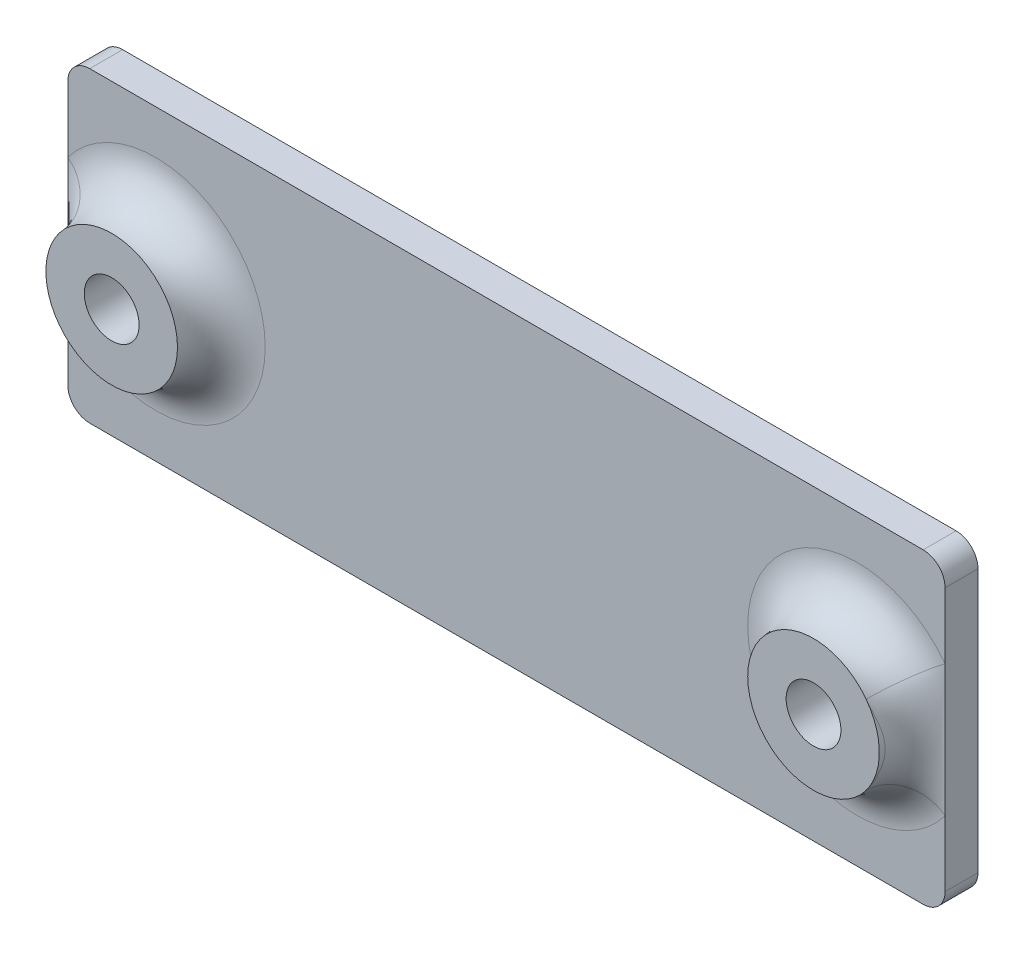
ISO-10303-21;
HEADER;
FILE_DESCRIPTION(('STEP AP214'),'2;1');
FILE_NAME('part.step','',(''),(''),'','','');
FILE_SCHEMA(('AUTOMOTIVE_DESIGN { 1 0 10303 214 1 1 1 1 }'));
ENDSEC;
DATA;
#1=APPLICATION_CONTEXT('core data for automotive mechanical design processes');
#2=APPLICATION_PROTOCOL_DEFINITION('international standard','automotive_design',2000,#1);
#3=PRODUCT_CONTEXT('',#1,'mechanical');
#4=PRODUCT('Part','Part','',(#3));
#5=PRODUCT_RELATED_PRODUCT_CATEGORY('part','',(#4));
#6=PRODUCT_DEFINITION_FORMATION('','',#4);
#7=PRODUCT_DEFINITION_CONTEXT('part definition',#1,'design');
#8=PRODUCT_DEFINITION('design','',#6,#7);
#9=PRODUCT_DEFINITION_SHAPE('','',#8);
#10=(LENGTH_UNIT() NAMED_UNIT(*) SI_UNIT(.MILLI.,.METRE.));
#11=(NAMED_UNIT(*) PLANE_ANGLE_UNIT() SI_UNIT($,.RADIAN.));
#12=(NAMED_UNIT(*) SI_UNIT($,.STERADIAN.) SOLID_ANGLE_UNIT());
#13=UNCERTAINTY_MEASURE_WITH_UNIT(LENGTH_MEASURE(1.E-05),#10,'distance_accuracy_value','');
#14=(GEOMETRIC_REPRESENTATION_CONTEXT(3) GLOBAL_UNCERTAINTY_ASSIGNED_CONTEXT((#13)) GLOBAL_UNIT_ASSIGNED_CONTEXT((#10,
#11,#12)) REPRESENTATION_CONTEXT('',''));
#15=CARTESIAN_POINT('',(0.,0.,0.));
#16=DIRECTION('',(0.,0.,1.));
#17=DIRECTION('',(1.,0.,0.));
#18=AXIS2_PLACEMENT_3D('',#15,#16,#17);
#19=CARTESIAN_POINT('',(-21.6888483995196,7.,1.5));
#20=DIRECTION('',(1.,0.,0.));
#21=DIRECTION('',(0.,1.,0.));
#22=AXIS2_PLACEMENT_3D('',#19,#20,#21);
#23=PLANE('',#22);
#24=DIRECTION('',(0.,-1.,0.));
#25=VECTOR('',#24,1.);
#26=CARTESIAN_POINT('',(-21.6888483995196,7.,1.5));
#27=LINE('',#26,#25);
#28=CARTESIAN_POINT('',(-21.6888483995196,6.,1.5));
#29=VERTEX_POINT('',#28);
#30=CARTESIAN_POINT('',(-21.6888483995196,3.,1.5));
#31=VERTEX_POINT('',#30);
#32=EDGE_CURVE('E167',#29,#31,#27,.T.);
#33=ORIENTED_EDGE('',*,*,#32,.F.);
#34=DIRECTION('',(0.,0.,-1.));
#35=VECTOR('',#34,1.);
#36=CARTESIAN_POINT('',(-21.6888483995196,6.,1.5));
#37=LINE('',#36,#35);
#38=CARTESIAN_POINT('',(-21.6888483995196,6.,0.));
#39=VERTEX_POINT('',#38);
#40=EDGE_CURVE('E287',#29,#39,#37,.T.);
#41=ORIENTED_EDGE('',*,*,#40,.T.);
#42=DIRECTION('',(0.,-1.,0.));
#43=VECTOR('',#42,1.);
#44=CARTESIAN_POINT('',(-21.6888483995196,7.,0.));
#45=LINE('',#44,#43);
#46=CARTESIAN_POINT('',(-21.6888483995196,-6.,0.));
#47=VERTEX_POINT('',#46);
#48=EDGE_CURVE('E166',#39,#47,#45,.T.);
#49=ORIENTED_EDGE('',*,*,#48,.T.);
#50=DIRECTION('',(0.,0.,-1.));
#51=VECTOR('',#50,1.);
#52=CARTESIAN_POINT('',(-21.6888483995196,-6.,1.5));
#53=LINE('',#52,#51);
#54=CARTESIAN_POINT('',(-21.6888483995196,-6.,1.5));
#55=VERTEX_POINT('',#54);
#56=EDGE_CURVE('E254',#47,#55,#53,.F.);
#57=ORIENTED_EDGE('',*,*,#56,.T.);
#58=CARTESIAN_POINT('',(-21.6888483995196,-3.,1.5));
#59=VERTEX_POINT('',#58);
#60=EDGE_CURVE('E171',#59,#55,#27,.T.);
#61=ORIENTED_EDGE('',*,*,#60,.F.);
#62=EDGE_CURVE('E170',#31,#59,#27,.T.);
#63=ORIENTED_EDGE('',*,*,#62,.F.);
#64=EDGE_LOOP('',(#33,#41,#49,#57,#61,#63));
#65=FACE_BOUND('',#64,.T.);
#66=ADVANCED_FACE('F35',(#65),#23,.F.);
#67=CARTESIAN_POINT('',(-21.6888483995196,-7.,1.5));
#68=DIRECTION('',(0.,1.,0.));
#69=DIRECTION('',(0.,0.,1.));
#70=AXIS2_PLACEMENT_3D('',#67,#68,#69);
#71=PLANE('',#70);
#72=DIRECTION('',(1.,0.,0.));
#73=VECTOR('',#72,1.);
#74=CARTESIAN_POINT('',(-21.6888483995196,-7.,0.));
#75=LINE('',#74,#73);
#76=CARTESIAN_POINT('',(-20.6888483995196,-7.,0.));
#77=VERTEX_POINT('',#76);
#78=CARTESIAN_POINT('',(17.3111516004804,-7.,0.));
#79=VERTEX_POINT('',#78);
#80=EDGE_CURVE('E180',#77,#79,#75,.T.);
#81=ORIENTED_EDGE('',*,*,#80,.T.);
#82=DIRECTION('',(0.,0.,-1.));
#83=VECTOR('',#82,1.);
#84=CARTESIAN_POINT('',(17.3111516004804,-7.,1.5));
#85=LINE('',#84,#83);
#86=CARTESIAN_POINT('',(17.3111516004804,-7.,1.5));
#87=VERTEX_POINT('',#86);
#88=EDGE_CURVE('E11',#79,#87,#85,.F.);
#89=ORIENTED_EDGE('',*,*,#88,.T.);
#90=DIRECTION('',(1.,0.,0.));
#91=VECTOR('',#90,1.);
#92=CARTESIAN_POINT('',(-21.6888483995196,-7.,1.5));
#93=LINE('',#92,#91);
#94=CARTESIAN_POINT('',(-20.6888483995196,-7.,1.5));
#95=VERTEX_POINT('',#94);
#96=EDGE_CURVE('E169',#95,#87,#93,.T.);
#97=ORIENTED_EDGE('',*,*,#96,.F.);
#98=DIRECTION('',(0.,0.,-1.));
#99=VECTOR('',#98,1.);
#100=CARTESIAN_POINT('',(-20.6888483995196,-7.,1.5));
#101=LINE('',#100,#99);
#102=EDGE_CURVE('E44',#95,#77,#101,.T.);
#103=ORIENTED_EDGE('',*,*,#102,.T.);
#104=EDGE_LOOP('',(#81,#89,#97,#103));
#105=FACE_BOUND('',#104,.T.);
#106=ADVANCED_FACE('F277',(#105),#71,.F.);
#107=CARTESIAN_POINT('',(18.3111516004804,7.,1.5));
#108=DIRECTION('',(-1.,0.,0.));
#109=DIRECTION('',(0.,-1.,0.));
#110=AXIS2_PLACEMENT_3D('',#107,#108,#109);
#111=PLANE('',#110);
#112=DIRECTION('',(0.,1.,0.));
#113=VECTOR('',#112,1.);
#114=CARTESIAN_POINT('',(18.3111516004804,7.,0.));
#115=LINE('',#114,#113);
#116=CARTESIAN_POINT('',(18.3111516004804,-6.,0.));
#117=VERTEX_POINT('',#116);
#118=CARTESIAN_POINT('',(18.3111516004804,6.,0.));
#119=VERTEX_POINT('',#118);
#120=EDGE_CURVE('E182',#117,#119,#115,.T.);
#121=ORIENTED_EDGE('',*,*,#120,.T.);
#122=DIRECTION('',(0.,0.,-1.));
#123=VECTOR('',#122,1.);
#124=CARTESIAN_POINT('',(18.3111516004804,6.,1.5));
#125=LINE('',#124,#123);
#126=CARTESIAN_POINT('',(18.3111516004804,6.,1.5));
#127=VERTEX_POINT('',#126);
#128=EDGE_CURVE('E319',#119,#127,#125,.F.);
#129=ORIENTED_EDGE('',*,*,#128,.T.);
#130=DIRECTION('',(0.,1.,0.));
#131=VECTOR('',#130,1.);
#132=CARTESIAN_POINT('',(18.3111516004804,7.,1.5));
#133=LINE('',#132,#131);
#134=CARTESIAN_POINT('',(18.3111516004804,2.99999999999999,1.5));
#135=VERTEX_POINT('',#134);
#136=EDGE_CURVE('E173',#135,#127,#133,.T.);
#137=ORIENTED_EDGE('',*,*,#136,.F.);
#138=CARTESIAN_POINT('',(18.3111516004804,-2.99999999999999,1.5));
#139=VERTEX_POINT('',#138);
#140=EDGE_CURVE('E134',#139,#135,#133,.T.);
#141=ORIENTED_EDGE('',*,*,#140,.F.);
#142=CARTESIAN_POINT('',(18.3111516004804,-6.,1.5));
#143=VERTEX_POINT('',#142);
#144=EDGE_CURVE('E174',#143,#139,#133,.T.);
#145=ORIENTED_EDGE('',*,*,#144,.F.);
#146=DIRECTION('',(0.,0.,-1.));
#147=VECTOR('',#146,1.);
#148=CARTESIAN_POINT('',(18.3111516004804,-6.,1.5));
#149=LINE('',#148,#147);
#150=EDGE_CURVE('E316',#143,#117,#149,.T.);
#151=ORIENTED_EDGE('',*,*,#150,.T.);
#152=EDGE_LOOP('',(#121,#129,#137,#141,#145,#151));
#153=FACE_BOUND('',#152,.T.);
#154=ADVANCED_FACE('F282',(#153),#111,.F.);
#155=CARTESIAN_POINT('',(-21.6888483995196,7.,1.5));
#156=DIRECTION('',(0.,-1.,0.));
#157=DIRECTION('',(0.,0.,-1.));
#158=AXIS2_PLACEMENT_3D('',#155,#156,#157);
#159=PLANE('',#158);
#160=DIRECTION('',(-1.,0.,0.));
#161=VECTOR('',#160,1.);
#162=CARTESIAN_POINT('',(-21.6888483995196,7.,0.));
#163=LINE('',#162,#161);
#164=CARTESIAN_POINT('',(17.3111516004804,7.,0.));
#165=VERTEX_POINT('',#164);
#166=CARTESIAN_POINT('',(-20.6888483995196,7.,0.));
#167=VERTEX_POINT('',#166);
#168=EDGE_CURVE('E185',#165,#167,#163,.T.);
#169=ORIENTED_EDGE('',*,*,#168,.T.);
#170=DIRECTION('',(0.,0.,-1.));
#171=VECTOR('',#170,1.);
#172=CARTESIAN_POINT('',(-20.6888483995196,7.,1.5));
#173=LINE('',#172,#171);
#174=CARTESIAN_POINT('',(-20.6888483995196,7.,1.5));
#175=VERTEX_POINT('',#174);
#176=EDGE_CURVE('E308',#167,#175,#173,.F.);
#177=ORIENTED_EDGE('',*,*,#176,.T.);
#178=DIRECTION('',(-1.,0.,0.));
#179=VECTOR('',#178,1.);
#180=CARTESIAN_POINT('',(-21.6888483995196,7.,1.5));
#181=LINE('',#180,#179);
#182=CARTESIAN_POINT('',(17.3111516004804,7.,1.5));
#183=VERTEX_POINT('',#182);
#184=EDGE_CURVE('E152',#183,#175,#181,.T.);
#185=ORIENTED_EDGE('',*,*,#184,.F.);
#186=DIRECTION('',(0.,0.,-1.));
#187=VECTOR('',#186,1.);
#188=CARTESIAN_POINT('',(17.3111516004804,7.,1.5));
#189=LINE('',#188,#187);
#190=EDGE_CURVE('E305',#183,#165,#189,.T.);
#191=ORIENTED_EDGE('',*,*,#190,.T.);
#192=EDGE_LOOP('',(#169,#177,#185,#191));
#193=FACE_BOUND('',#192,.T.);
#194=ADVANCED_FACE('F353',(#193),#159,.F.);
#195=CARTESIAN_POINT('',(0.,0.,1.5));
#196=DIRECTION('',(0.,0.,1.));
#197=DIRECTION('',(1.,0.,0.));
#198=AXIS2_PLACEMENT_3D('',#195,#196,#197);
#199=PLANE('',#198);
#200=ORIENTED_EDGE('',*,*,#184,.T.);
#201=CARTESIAN_POINT('',(-20.6888483995196,6.,1.5));
#202=DIRECTION('',(0.,0.,1.));
#203=DIRECTION('',(1.,0.,0.));
#204=AXIS2_PLACEMENT_3D('',#201,#202,#203);
#205=CIRCLE('',#204,1.);
#206=EDGE_CURVE('E294',#175,#29,#205,.T.);
#207=ORIENTED_EDGE('',*,*,#206,.T.);
#208=ORIENTED_EDGE('',*,*,#32,.T.);
#209=CARTESIAN_POINT('',(-17.6888483995196,0.,1.5));
#210=DIRECTION('',(0.,0.,1.));
#211=DIRECTION('',(1.,0.,0.));
#212=AXIS2_PLACEMENT_3D('',#209,#210,#211);
#213=CIRCLE('',#212,5.);
#214=EDGE_CURVE('E151',#31,#59,#213,.F.);
#215=ORIENTED_EDGE('',*,*,#214,.T.);
#216=ORIENTED_EDGE('',*,*,#60,.T.);
#217=CARTESIAN_POINT('',(-20.6888483995196,-6.,1.5));
#218=DIRECTION('',(0.,0.,1.));
#219=DIRECTION('',(1.,0.,0.));
#220=AXIS2_PLACEMENT_3D('',#217,#218,#219);
#221=CIRCLE('',#220,1.);
#222=EDGE_CURVE('E57',#55,#95,#221,.T.);
#223=ORIENTED_EDGE('',*,*,#222,.T.);
#224=ORIENTED_EDGE('',*,*,#96,.T.);
#225=CARTESIAN_POINT('',(17.3111516004804,-6.,1.5));
#226=DIRECTION('',(0.,0.,1.));
#227=DIRECTION('',(1.,0.,0.));
#228=AXIS2_PLACEMENT_3D('',#225,#226,#227);
#229=CIRCLE('',#228,1.);
#230=EDGE_CURVE('E311',#87,#143,#229,.T.);
#231=ORIENTED_EDGE('',*,*,#230,.T.);
#232=ORIENTED_EDGE('',*,*,#144,.T.);
#233=CARTESIAN_POINT('',(14.3111516004804,0.,1.5));
#234=DIRECTION('',(0.,0.,1.));
#235=DIRECTION('',(1.,0.,0.));
#236=AXIS2_PLACEMENT_3D('',#233,#234,#235);
#237=CIRCLE('',#236,5.);
#238=EDGE_CURVE('E335',#139,#135,#237,.F.);
#239=ORIENTED_EDGE('',*,*,#238,.T.);
#240=ORIENTED_EDGE('',*,*,#136,.T.);
#241=CARTESIAN_POINT('',(17.3111516004804,6.,1.5));
#242=DIRECTION('',(0.,0.,1.));
#243=DIRECTION('',(1.,0.,0.));
#244=AXIS2_PLACEMENT_3D('',#241,#242,#243);
#245=CIRCLE('',#244,1.);
#246=EDGE_CURVE('E313',#127,#183,#245,.T.);
#247=ORIENTED_EDGE('',*,*,#246,.T.);
#248=EDGE_LOOP('',(#200,#207,#208,#215,#216,#223,#224,#231,#232,#239,#240,#247));
#249=FACE_BOUND('',#248,.T.);
#250=ADVANCED_FACE('F347',(#249),#199,.T.);
#251=CARTESIAN_POINT('',(0.,0.,0.));
#252=DIRECTION('',(0.,0.,1.));
#253=DIRECTION('',(1.,0.,0.));
#254=AXIS2_PLACEMENT_3D('',#251,#252,#253);
#255=PLANE('',#254);
#256=CARTESIAN_POINT('',(-17.6888483995196,0.,0.));
#257=DIRECTION('',(0.,0.,1.));
#258=DIRECTION('',(1.,0.,0.));
#259=AXIS2_PLACEMENT_3D('',#256,#257,#258);
#260=CIRCLE('',#259,1.25);
#261=CARTESIAN_POINT('',(-16.4388483995196,0.,0.));
#262=VERTEX_POINT('',#261);
#263=EDGE_CURVE('E39',#262,#262,#260,.T.);
#264=ORIENTED_EDGE('',*,*,#263,.T.);
#265=EDGE_LOOP('',(#264));
#266=FACE_BOUND('',#265,.T.);
#267=CARTESIAN_POINT('',(14.3111516004804,0.,0.));
#268=DIRECTION('',(0.,0.,1.));
#269=DIRECTION('',(1.,0.,0.));
#270=AXIS2_PLACEMENT_3D('',#267,#268,#269);
#271=CIRCLE('',#270,1.25);
#272=CARTESIAN_POINT('',(15.5611516004804,0.,0.));
#273=VERTEX_POINT('',#272);
#274=EDGE_CURVE('E322',#273,#273,#271,.T.);
#275=ORIENTED_EDGE('',*,*,#274,.T.);
#276=EDGE_LOOP('',(#275));
#277=FACE_BOUND('',#276,.T.);
#278=ORIENTED_EDGE('',*,*,#48,.F.);
#279=CARTESIAN_POINT('',(-20.6888483995196,6.,0.));
#280=DIRECTION('',(0.,0.,1.));
#281=DIRECTION('',(1.,0.,0.));
#282=AXIS2_PLACEMENT_3D('',#279,#280,#281);
#283=CIRCLE('',#282,1.);
#284=EDGE_CURVE('E295',#39,#167,#283,.F.);
#285=ORIENTED_EDGE('',*,*,#284,.T.);
#286=ORIENTED_EDGE('',*,*,#168,.F.);
#287=CARTESIAN_POINT('',(17.3111516004804,6.,0.));
#288=DIRECTION('',(0.,0.,1.));
#289=DIRECTION('',(1.,0.,0.));
#290=AXIS2_PLACEMENT_3D('',#287,#288,#289);
#291=CIRCLE('',#290,1.);
#292=EDGE_CURVE('E302',#165,#119,#291,.F.);
#293=ORIENTED_EDGE('',*,*,#292,.T.);
#294=ORIENTED_EDGE('',*,*,#120,.F.);
#295=CARTESIAN_POINT('',(17.3111516004804,-6.,0.));
#296=DIRECTION('',(0.,0.,1.));
#297=DIRECTION('',(1.,0.,0.));
#298=AXIS2_PLACEMENT_3D('',#295,#296,#297);
#299=CIRCLE('',#298,1.);
#300=EDGE_CURVE('E297',#117,#79,#299,.F.);
#301=ORIENTED_EDGE('',*,*,#300,.T.);
#302=ORIENTED_EDGE('',*,*,#80,.F.);
#303=CARTESIAN_POINT('',(-20.6888483995196,-6.,0.));
#304=DIRECTION('',(0.,0.,1.));
#305=DIRECTION('',(1.,0.,0.));
#306=AXIS2_PLACEMENT_3D('',#303,#304,#305);
#307=CIRCLE('',#306,1.);
#308=EDGE_CURVE('E296',#77,#47,#307,.F.);
#309=ORIENTED_EDGE('',*,*,#308,.T.);
#310=EDGE_LOOP('',(#278,#285,#286,#293,#294,#301,#302,#309));
#311=FACE_BOUND('',#310,.T.);
#312=ADVANCED_FACE('F355',(#266,#277,#311),#255,.F.);
#313=CARTESIAN_POINT('',(-17.6888483995196,0.,3.5));
#314=DIRECTION('',(0.,0.,1.));
#315=DIRECTION('',(1.,0.,0.));
#316=AXIS2_PLACEMENT_3D('',#313,#314,#315);
#317=PLANE('',#316);
#318=CARTESIAN_POINT('',(-17.6888483995196,0.,3.5));
#319=DIRECTION('',(0.,0.,1.));
#320=DIRECTION('',(1.,0.,0.));
#321=AXIS2_PLACEMENT_3D('',#318,#319,#320);
#322=CIRCLE('',#321,3.);
#323=CARTESIAN_POINT('',(-20.0888483995196,1.8,3.5));
#324=VERTEX_POINT('',#323);
#325=CARTESIAN_POINT('',(-20.0888483995196,-1.8,3.5));
#326=VERTEX_POINT('',#325);
#327=EDGE_CURVE('E163',#324,#326,#322,.T.);
#328=ORIENTED_EDGE('',*,*,#327,.T.);
#329=EDGE_CURVE('E162',#326,#324,#322,.T.);
#330=ORIENTED_EDGE('',*,*,#329,.T.);
#331=EDGE_LOOP('',(#328,#330));
#332=FACE_BOUND('',#331,.T.);
#333=CARTESIAN_POINT('',(-17.6888483995196,0.,3.5));
#334=DIRECTION('',(0.,0.,1.));
#335=DIRECTION('',(1.,0.,0.));
#336=AXIS2_PLACEMENT_3D('',#333,#334,#335);
#337=CIRCLE('',#336,1.25);
#338=CARTESIAN_POINT('',(-16.4388483995196,0.,3.5));
#339=VERTEX_POINT('',#338);
#340=EDGE_CURVE('E146',#339,#339,#337,.T.);
#341=ORIENTED_EDGE('',*,*,#340,.F.);
#342=EDGE_LOOP('',(#341));
#343=FACE_BOUND('',#342,.T.);
#344=ADVANCED_FACE('F361',(#332,#343),#317,.T.);
#345=CARTESIAN_POINT('',(-17.6888483995196,0.,3.5));
#346=DIRECTION('',(0.,0.,-1.));
#347=DIRECTION('',(-1.,0.,0.));
#348=AXIS2_PLACEMENT_3D('',#345,#346,#347);
#349=CYLINDRICAL_SURFACE('',#348,3.);
#350=ORIENTED_EDGE('',*,*,#327,.F.);
#351=CARTESIAN_POINT('',(-19.625073339999,2.29151325107793,3.34459623266826));
#352=CARTESIAN_POINT('',(-20.2259303967906,1.78381624409983,0.886979770266504));
#353=CARTESIAN_POINT('',(-21.6888483995196,3.81918875179655,1.5));
#354=CARTESIAN_POINT('',(-19.6594334356451,2.26249320423382,3.3685897639057));
#355=CARTESIAN_POINT('',(-20.1895156786684,1.79923649069805,0.924660127781199));
#356=CARTESIAN_POINT('',(-21.6888483995196,3.77082200705822,1.5));
#357=CARTESIAN_POINT('',(-19.6935714937843,2.23231086073215,3.3893022147228));
#358=CARTESIAN_POINT('',(-20.159337137352,1.81266701152846,0.965849878144084));
#359=CARTESIAN_POINT('',(-21.6888483995196,3.72051810122234,1.5));
#360=CARTESIAN_POINT('',(-19.7609605513506,2.16989477186767,3.42479180399118));
#361=CARTESIAN_POINT('',(-20.1115232257665,1.83377440660022,1.0513796191233));
#362=CARTESIAN_POINT('',(-21.6888483995196,3.61649128644754,1.5));
#363=CARTESIAN_POINT('',(-19.79421304887,2.13766485075336,3.43957965094296));
#364=CARTESIAN_POINT('',(-20.0936556406761,1.841558357961,1.09559528154323));
#365=CARTESIAN_POINT('',(-21.6888483995196,3.5627747512561,1.5));
#366=CARTESIAN_POINT('',(-19.8914564677109,2.03886899327349,3.47583913137446));
#367=CARTESIAN_POINT('',(-20.0576531899529,1.85446086177177,1.2263405687183));
#368=CARTESIAN_POINT('',(-21.6888483995196,3.39811498878818,1.5));
#369=CARTESIAN_POINT('',(-19.9536956739496,1.96955687719517,3.48969771559521));
#370=CARTESIAN_POINT('',(-20.0544159789844,1.85053257156897,1.31428601032067));
#371=CARTESIAN_POINT('',(-21.6888483995196,3.28259479532498,1.5));
#372=CARTESIAN_POINT('',(-20.0988981588271,1.79171971875177,3.50513098910025));
#373=CARTESIAN_POINT('',(-20.0823435671282,1.80594853689707,1.51179519053915));
#374=CARTESIAN_POINT('',(-21.6888483995196,2.9861995312534,1.5));
#375=CARTESIAN_POINT('',(-20.1780965335728,1.67990963967534,3.49803514666745));
#376=CARTESIAN_POINT('',(-20.1276989315751,1.75126965460357,1.61654775220571));
#377=CARTESIAN_POINT('',(-21.6888483995196,2.79984939945899,1.5));
#378=CARTESIAN_POINT('',(-20.3205102979766,1.44679505130484,3.46604554690881));
#379=CARTESIAN_POINT('',(-20.2378783566629,1.59278002565308,1.78542230897414));
#380=CARTESIAN_POINT('',(-21.6888483995196,2.41132508550797,1.5));
#381=CARTESIAN_POINT('',(-20.383625541345,1.32543692890073,3.44104379660688));
#382=CARTESIAN_POINT('',(-20.3023260603553,1.49036860769577,1.85182924577125));
#383=CARTESIAN_POINT('',(-21.6888483995196,2.20906154816797,1.5));
#384=CARTESIAN_POINT('',(-20.4954480158768,1.06932774491697,3.38433892455513));
#385=CARTESIAN_POINT('',(-20.4275018983752,1.24642066542046,1.9546310241978));
#386=CARTESIAN_POINT('',(-21.6888483995196,1.78221290819485,1.5));
#387=CARTESIAN_POINT('',(-20.5432704918354,0.934210045822397,3.35236191094447));
#388=CARTESIAN_POINT('',(-20.4889314601524,1.10299445697928,1.99129806440374));
#389=CARTESIAN_POINT('',(-21.6888483995196,1.55701674303686,1.5));
#390=CARTESIAN_POINT('',(-20.6002187387398,0.727345296229331,3.30963984036596));
#391=CARTESIAN_POINT('',(-20.5647597068115,0.87016507003907,2.02961411647951));
#392=CARTESIAN_POINT('',(-21.6888483995196,1.21224216038246,1.5));
#393=CARTESIAN_POINT('',(-20.6167295551275,0.657752620595921,3.29628209361614));
#394=CARTESIAN_POINT('',(-20.5872906883449,0.790177099010609,2.03965351473958));
#395=CARTESIAN_POINT('',(-21.6888483995196,1.09625436766056,1.5));
#396=CARTESIAN_POINT('',(-20.6447614136864,0.51739254939534,3.27263861094219));
#397=CARTESIAN_POINT('',(-20.6259942497066,0.626189170257007,2.05564441477265));
#398=CARTESIAN_POINT('',(-21.6888483995196,0.862320915659571,1.5));
#399=CARTESIAN_POINT('',(-20.656284227165,0.446625580120499,3.26235178489592));
#400=CARTESIAN_POINT('',(-20.6422904868942,0.541964552750951,2.06166113198854));
#401=CARTESIAN_POINT('',(-21.6888483995196,0.744375966867703,1.5));
#402=CARTESIAN_POINT('',(-20.6757269936194,0.292481969211618,3.24461039344351));
#403=CARTESIAN_POINT('',(-20.6698736139518,0.356949362898065,2.07137421800582));
#404=CARTESIAN_POINT('',(-21.6888483995196,0.487469948685797,1.5));
#405=CARTESIAN_POINT('',(-20.68273533112,0.208956357190311,3.23790609828467));
#406=CARTESIAN_POINT('',(-20.6800250757187,0.255217245298435,2.07457585305403));
#407=CARTESIAN_POINT('',(-21.6888483995196,0.348260595317076,1.5));
#408=CARTESIAN_POINT('',(-20.6897314397356,0.0415091793797495,3.23121351244036));
#409=CARTESIAN_POINT('',(-20.6901125748262,0.0509512877452495,2.0777576274594));
#410=CARTESIAN_POINT('',(-21.6888483995196,0.0691819656330256,1.5));
#411=CARTESIAN_POINT('',(-20.6897189164862,-0.0424124028638719,3.23122550334931));
#412=CARTESIAN_POINT('',(-20.690095576538,-0.0520583764675275,2.07775257876575));
#413=CARTESIAN_POINT('',(-21.6888483995196,-0.0706873381062491,1.5));
#414=CARTESIAN_POINT('',(-20.6826678847455,-0.209959913843554,3.23797060867247));
#415=CARTESIAN_POINT('',(-20.6799265903061,-0.256438207221116,2.0745444743887));
#416=CARTESIAN_POINT('',(-21.6888483995196,-0.34993318973946,1.5));
#417=CARTESIAN_POINT('',(-20.6756210940129,-0.293585377446472,3.24471164595656));
#418=CARTESIAN_POINT('',(-20.6697147468806,-0.358283250557749,2.07132253331523));
#419=CARTESIAN_POINT('',(-21.6888483995196,-0.489308962411493,1.5));
#420=CARTESIAN_POINT('',(-20.654601358024,-0.459699662094655,3.2638828123132));
#421=CARTESIAN_POINT('',(-20.6398958083252,-0.557751836027316,2.06081365954058));
#422=CARTESIAN_POINT('',(-21.6888483995196,-0.766166103491818,1.5));
#423=CARTESIAN_POINT('',(-20.6406281581002,-0.542188441232112,3.2763131505665));
#424=CARTESIAN_POINT('',(-20.6201529543808,-0.655806035959113,2.05347351527688));
#425=CARTESIAN_POINT('',(-21.6888483995196,-0.903647402053765,1.5));
#426=CARTESIAN_POINT('',(-20.5923041133163,-0.769486913855837,3.31639810618621));
#427=CARTESIAN_POINT('',(-20.5534493095072,-0.92087596495881,2.02503539548745));
#428=CARTESIAN_POINT('',(-21.6888483995196,-1.28247818975929,1.5));
#429=CARTESIAN_POINT('',(-20.5505649673685,-0.912495235770091,3.34835079987227));
#430=CARTESIAN_POINT('',(-20.4968791241898,-1.08111631700572,1.99737005192039));
#431=CARTESIAN_POINT('',(-21.6888483995196,-1.52082539295003,1.5));
#432=CARTESIAN_POINT('',(-20.44636037078,-1.19089979210492,3.41140118097135));
#433=CARTESIAN_POINT('',(-20.3706658232055,-1.36701355896341,1.9118911817773));
#434=CARTESIAN_POINT('',(-21.6888483995196,-1.98483298684165,1.5));
#435=CARTESIAN_POINT('',(-20.383883736336,-1.32629187288129,3.44249839720142));
#436=CARTESIAN_POINT('',(-20.2997105862707,-1.49324783698747,1.85239462890305));
#437=CARTESIAN_POINT('',(-21.6888483995196,-2.21048645480219,1.5));
#438=CARTESIAN_POINT('',(-20.2550201589621,-1.55828648554705,3.48304239086743));
#439=CARTESIAN_POINT('',(-20.1844809507541,-1.67273998842703,1.71061694297313));
#440=CARTESIAN_POINT('',(-21.6888483995196,-2.59714414257839,1.5));
#441=CARTESIAN_POINT('',(-20.1925523658529,-1.656846450863,3.49575598585983));
#442=CARTESIAN_POINT('',(-20.1372480822932,-1.73592460840155,1.63411030848365));
#443=CARTESIAN_POINT('',(-21.6888483995196,-2.76141075143831,1.5));
#444=CARTESIAN_POINT('',(-20.0566176789032,-1.84583100413364,3.50246991245705));
#445=CARTESIAN_POINT('',(-20.0707690855096,-1.8238850515799,1.45622962042464));
#446=CARTESIAN_POINT('',(-21.6888483995196,-3.07638500688943,1.5));
#447=CARTESIAN_POINT('',(-19.9832097770583,-1.93629529662107,3.49656738078856));
#448=CARTESIAN_POINT('',(-20.0525721773599,-1.84721461615487,1.35346625709373));
#449=CARTESIAN_POINT('',(-21.6888483995196,-3.22715882770188,1.5));
#450=CARTESIAN_POINT('',(-19.8489116915293,-2.08354332086611,3.46191679000326));
#451=CARTESIAN_POINT('',(-20.0689994804338,-1.85210341693975,1.16867600284446));
#452=CARTESIAN_POINT('',(-21.6888483995196,-3.47257220144345,1.5));
#453=CARTESIAN_POINT('',(-19.7901124643493,-2.14275829406696,3.43988060894686));
#454=CARTESIAN_POINT('',(-20.0918742101897,-1.84242911173119,1.08765084753282));
#455=CARTESIAN_POINT('',(-21.6888483995196,-3.57126382344472,1.5));
#456=CARTESIAN_POINT('',(-19.6995893805765,-2.22680149334239,3.39259600028462));
#457=CARTESIAN_POINT('',(-20.1547655029324,-1.81469478711713,0.97347895702005));
#458=CARTESIAN_POINT('',(-21.6888483995196,-3.71133582223743,1.5));
#459=CARTESIAN_POINT('',(-19.6688661070745,-2.25414542663921,3.37433352136806));
#460=CARTESIAN_POINT('',(-20.1812105189673,-1.80292163107956,0.936102637925062));
#461=CARTESIAN_POINT('',(-21.6888483995196,-3.75690904439899,1.5));
#462=CARTESIAN_POINT('',(-19.6070383274281,-2.3069922893785,3.33255591258014));
#463=CARTESIAN_POINT('',(-20.2443053270786,-1.77592195573733,0.86609893085249));
#464=CARTESIAN_POINT('',(-21.6888483995196,-3.84498714896463,1.5));
#465=CARTESIAN_POINT('',(-19.5759333041581,-2.33249229938537,3.30903268447403));
#466=CARTESIAN_POINT('',(-20.2810987268939,-1.76065126330735,0.833616216707175));
#467=CARTESIAN_POINT('',(-21.6888483995196,-3.88748716564269,1.5));
#468=CARTESIAN_POINT('',(-19.544838017119,-2.3569689305045,3.28267332322388));
#469=CARTESIAN_POINT('',(-20.3226413989152,-1.7444894945374,0.805134613322167));
#470=CARTESIAN_POINT('',(-21.6888483995196,-3.92828155084084,1.5));
#471=(BOUNDED_SURFACE() B_SPLINE_SURFACE(3,2,((#351,#352,#353),(#354,#355,#356),(#357,#358,
#359),(#360,#361,#362),(#363,#364,#365),(#366,#367,#368),(#369,#370,#371),(#372,#373,#374),
(#375,#376,#377),(#378,#379,#380),(#381,#382,#383),(#384,#385,#386),(#387,#388,#389),(#390,#391,
#392),(#393,#394,#395),(#396,#397,#398),(#399,#400,#401),(#402,#403,#404),(#405,#406,#407),
(#408,#409,#410),(#411,#412,#413),(#414,#415,#416),(#417,#418,#419),(#420,#421,#422),(#423,#424,
#425),(#426,#427,#428),(#429,#430,#431),(#432,#433,#434),(#435,#436,#437),(#438,#439,#440),
(#441,#442,#443),(#444,#445,#446),(#447,#448,#449),(#450,#451,#452),(#453,#454,#455),(#456,#457,
#458),(#459,#460,#461),(#462,#463,#464),(#465,#466,#467),(#468,#469,#470)),.UNSPECIFIED.,.F.,
.F.,.F.) B_SPLINE_SURFACE_WITH_KNOTS((4,2,2,2,2,2,2,2,2,2,2,2,2,2,2,2,2,2,2,4),(3,3),(0.,
0.23589980962002,0.471371294428399,0.937191618804075,1.61891365016594,2.30478224355379,
3.0251614243213,3.38474678170021,3.74420434048272,4.163139006101,4.58209123643783,
5.00153732929496,5.42099884533014,6.16905979744192,6.91752483882847,7.50049483276309,
8.0804280009517,8.50125792050059,8.71383636852056,8.92674433364753),(0.,1.),
.UNSPECIFIED.) GEOMETRIC_REPRESENTATION_ITEM() RATIONAL_B_SPLINE_SURFACE(((1.,0.612602277513248,
1.),(1.,0.618334731206808,1.),(1.,0.624356895830462,1.),(1.,0.636803087114814,1.),(1.,
0.643226364258198,1.),(1.,0.662723268334925,1.),(1.,0.676155725407439,1.),(1.,0.70901631984957,
1.),(1.,0.72833781340313,1.),(1.,0.764392326345909,1.),(1.,0.781108886558122,1.),(1.,
0.811344446178376,1.),(1.,0.824660232792697,1.),(1.,0.840688206962777,1.),(1.,0.845370963122434,
1.),(1.,0.853354940909502,1.),(1.,0.856656652950325,1.),(1.,0.862239559825622,1.),(1.,
0.864261501472112,1.),(1.,0.866279966067433,1.),(1.,0.866276404092765,1.),(1.,0.864241991647046,
1.),(1.,0.862208751405374,1.),(1.,0.856173825932715,1.),(1.,0.852172068324074,1.),(1.,
0.838429135712603,1.),(1.,0.826647633542064,1.),(1.,0.797964814264204,1.),(1.,0.781060734961356,
1.),(1.,0.747662648100055,1.),(1.,0.731904422129649,1.),(1.,0.699304272193991,1.),(1.,
0.682468421079346,1.),(1.,0.654003579876838,1.),(1.,0.642213277160667,1.),(1.,0.625455987928859,
1.),(1.,0.619999695311859,1.),(1.,0.609534210086508,1.),(1.,0.604525723636687,1.),(1.,
0.599805799404888,1.))) REPRESENTATION_ITEM('') SURFACE());
#472=CARTESIAN_POINT('',(-19.625073339999,2.29151325107793,3.34459623266826));
#473=CARTESIAN_POINT('',(-19.6594334356451,2.26249320423382,3.3685897639057));
#474=CARTESIAN_POINT('',(-19.6935714937843,2.23231086073215,3.3893022147228));
#475=CARTESIAN_POINT('',(-19.7609605513506,2.16989477186767,3.42479180399118));
#476=CARTESIAN_POINT('',(-19.79421304887,2.13766485075336,3.43957965094296));
#477=CARTESIAN_POINT('',(-19.8914564677109,2.03886899327349,3.47583913137446));
#478=CARTESIAN_POINT('',(-19.9536956739496,1.96955687719517,3.48969771559521));
#479=CARTESIAN_POINT('',(-20.0988981588271,1.79171971875177,3.50513098910025));
#480=CARTESIAN_POINT('',(-20.1780965335728,1.67990963967534,3.49803514666745));
#481=CARTESIAN_POINT('',(-20.3205102979766,1.44679505130484,3.46604554690881));
#482=CARTESIAN_POINT('',(-20.383625541345,1.32543692890073,3.44104379660688));
#483=CARTESIAN_POINT('',(-20.4954480158768,1.06932774491697,3.38433892455513));
#484=CARTESIAN_POINT('',(-20.5432704918354,0.934210045822397,3.35236191094447));
#485=CARTESIAN_POINT('',(-20.6002187387398,0.727345296229331,3.30963984036596));
#486=CARTESIAN_POINT('',(-20.6167295551275,0.657752620595921,3.29628209361614));
#487=CARTESIAN_POINT('',(-20.6447614136864,0.51739254939534,3.27263861094219));
#488=CARTESIAN_POINT('',(-20.656284227165,0.446625580120499,3.26235178489592));
#489=CARTESIAN_POINT('',(-20.6757269936194,0.292481969211618,3.24461039344351));
#490=CARTESIAN_POINT('',(-20.68273533112,0.208956357190311,3.23790609828466));
#491=CARTESIAN_POINT('',(-20.6897314397356,0.0415091793797494,3.23121351244036));
#492=CARTESIAN_POINT('',(-20.6897189164862,-0.0424124028638719,3.23122550334931));
#493=CARTESIAN_POINT('',(-20.6826678847455,-0.209959913843554,3.23797060867247));
#494=CARTESIAN_POINT('',(-20.6756210940129,-0.293585377446472,3.24471164595656));
#495=CARTESIAN_POINT('',(-20.654601358024,-0.459699662094655,3.2638828123132));
#496=CARTESIAN_POINT('',(-20.6406281581002,-0.542188441232112,3.2763131505665));
#497=CARTESIAN_POINT('',(-20.5923041133163,-0.769486913855838,3.31639810618621));
#498=CARTESIAN_POINT('',(-20.5505649673685,-0.912495235770091,3.34835079987227));
#499=CARTESIAN_POINT('',(-20.44636037078,-1.19089979210492,3.41140118097135));
#500=CARTESIAN_POINT('',(-20.383883736336,-1.32629187288129,3.44249839720142));
#501=CARTESIAN_POINT('',(-20.2550201589621,-1.55828648554705,3.48304239086743));
#502=CARTESIAN_POINT('',(-20.1925523658529,-1.656846450863,3.49575598585983));
#503=CARTESIAN_POINT('',(-20.0566176789032,-1.84583100413364,3.50246991245705));
#504=CARTESIAN_POINT('',(-19.9832097770583,-1.93629529662107,3.49656738078856));
#505=CARTESIAN_POINT('',(-19.8489116915293,-2.08354332086611,3.46191679000326));
#506=CARTESIAN_POINT('',(-19.7901124643493,-2.14275829406696,3.43988060894686));
#507=CARTESIAN_POINT('',(-19.6995893805765,-2.22680149334239,3.39259600028462));
#508=CARTESIAN_POINT('',(-19.6688661070745,-2.25414542663921,3.37433352136806));
#509=CARTESIAN_POINT('',(-19.6070383274281,-2.3069922893785,3.33255591258014));
#510=CARTESIAN_POINT('',(-19.5759333041582,-2.33249229938537,3.30903268447403));
#511=CARTESIAN_POINT('',(-19.544838017119,-2.3569689305045,3.28267332322388));
#512=B_SPLINE_CURVE_WITH_KNOTS('',3,(#472,#473,#474,#475,#476,#477,#478,#479,#480,#481,#482,
#483,#484,#485,#486,#487,#488,#489,#490,#491,#492,#493,#494,#495,#496,#497,#498,#499,#500,#501,
#502,#503,#504,#505,#506,#507,#508,#509,#510,#511),.UNSPECIFIED.,.F.,.F.,(4,2,2,2,2,2,2,2,2,2,2,
2,2,2,2,2,2,2,2,4),(0.,0.23589980962002,0.471371294428399,0.937191618804075,1.61891365016594,
2.30478224355379,3.0251614243213,3.38474678170021,3.74420434048272,4.163139006101,
4.58209123643783,5.00153732929496,5.42099884533014,6.16905979744192,6.91752483882847,
7.50049483276309,8.0804280009517,8.50125792050059,8.71383636852056,8.92674433364753),.UNSPECIFIED.);
#513=EDGE_CURVE('E299',#324,#326,#512,.T.);
#514=ORIENTED_EDGE('',*,*,#513,.T.);
#515=EDGE_LOOP('',(#350,#514));
#516=FACE_BOUND('',#515,.T.);
#517=ADVANCED_FACE('F243',(#516),#349,.T.);
#518=CARTESIAN_POINT('',(-17.6888483995196,0.,3.5));
#519=DIRECTION('',(0.,0.,-1.));
#520=DIRECTION('',(-1.,0.,0.));
#521=AXIS2_PLACEMENT_3D('',#518,#519,#520);
#522=CYLINDRICAL_SURFACE('',#521,1.25);
#523=ORIENTED_EDGE('',*,*,#340,.T.);
#524=EDGE_LOOP('',(#523));
#525=FACE_BOUND('',#524,.T.);
#526=ORIENTED_EDGE('',*,*,#263,.F.);
#527=EDGE_LOOP('',(#526));
#528=FACE_BOUND('',#527,.T.);
#529=ADVANCED_FACE('F419',(#525,#528),#522,.F.);
#530=CARTESIAN_POINT('',(14.3111516004804,0.,3.5));
#531=DIRECTION('',(0.,0.,1.));
#532=DIRECTION('',(1.,0.,0.));
#533=AXIS2_PLACEMENT_3D('',#530,#531,#532);
#534=PLANE('',#533);
#535=CARTESIAN_POINT('',(14.3111516004804,0.,3.5));
#536=DIRECTION('',(0.,0.,1.));
#537=DIRECTION('',(1.,0.,0.));
#538=AXIS2_PLACEMENT_3D('',#535,#536,#537);
#539=CIRCLE('',#538,3.);
#540=CARTESIAN_POINT('',(16.7111516004804,1.8,3.5));
#541=VERTEX_POINT('',#540);
#542=CARTESIAN_POINT('',(16.7111516004804,-1.8,3.5));
#543=VERTEX_POINT('',#542);
#544=EDGE_CURVE('E142',#541,#543,#539,.T.);
#545=ORIENTED_EDGE('',*,*,#544,.T.);
#546=EDGE_CURVE('E147',#543,#541,#539,.T.);
#547=ORIENTED_EDGE('',*,*,#546,.T.);
#548=EDGE_LOOP('',(#545,#547));
#549=FACE_BOUND('',#548,.T.);
#550=CARTESIAN_POINT('',(14.3111516004804,0.,3.5));
#551=DIRECTION('',(0.,0.,1.));
#552=DIRECTION('',(1.,0.,0.));
#553=AXIS2_PLACEMENT_3D('',#550,#551,#552);
#554=CIRCLE('',#553,1.25);
#555=CARTESIAN_POINT('',(15.5611516004804,0.,3.5));
#556=VERTEX_POINT('',#555);
#557=EDGE_CURVE('E156',#556,#556,#554,.T.);
#558=ORIENTED_EDGE('',*,*,#557,.F.);
#559=EDGE_LOOP('',(#558));
#560=FACE_BOUND('',#559,.T.);
#561=ADVANCED_FACE('F154',(#549,#560),#534,.T.);
#562=CARTESIAN_POINT('',(14.3111516004804,0.,3.5));
#563=DIRECTION('',(0.,0.,-1.));
#564=DIRECTION('',(-1.,0.,0.));
#565=AXIS2_PLACEMENT_3D('',#562,#563,#564);
#566=CYLINDRICAL_SURFACE('',#565,3.);
#567=ORIENTED_EDGE('',*,*,#546,.F.);
#568=CARTESIAN_POINT('',(16.2473765409597,-2.29151325107793,3.34459623266826));
#569=CARTESIAN_POINT('',(16.8482335977513,-1.78381624409982,0.886979770266508));
#570=CARTESIAN_POINT('',(18.3111516004804,-3.81918875179655,1.5));
#571=CARTESIAN_POINT('',(16.2817366366058,-2.26249320423382,3.3685897639057));
#572=CARTESIAN_POINT('',(16.8118188796291,-1.79923649069805,0.924660127781203));
#573=CARTESIAN_POINT('',(18.3111516004804,-3.77082200705821,1.5));
#574=CARTESIAN_POINT('',(16.315874694745,-2.23231086073215,3.3893022147228));
#575=CARTESIAN_POINT('',(16.7816403383128,-1.81266701152847,0.965849878144088));
#576=CARTESIAN_POINT('',(18.3111516004804,-3.72051810122234,1.5));
#577=CARTESIAN_POINT('',(16.3832637523114,-2.16989477186767,3.42479180399118));
#578=CARTESIAN_POINT('',(16.7338264267273,-1.83377440660022,1.0513796191233));
#579=CARTESIAN_POINT('',(18.3111516004804,-3.61649128644753,1.5));
#580=CARTESIAN_POINT('',(16.4165162498308,-2.13766485075336,3.43957965094296));
#581=CARTESIAN_POINT('',(16.7159588416368,-1.841558357961,1.09559528154323));
#582=CARTESIAN_POINT('',(18.3111516004804,-3.56277475125609,1.5));
#583=CARTESIAN_POINT('',(16.5137596686716,-2.03886899327349,3.47583913137446));
#584=CARTESIAN_POINT('',(16.6799563909136,-1.85446086177176,1.2263405687183));
#585=CARTESIAN_POINT('',(18.3111516004804,-3.39811498878816,1.5));
#586=CARTESIAN_POINT('',(16.5759988749103,-1.96955687719516,3.48969771559521));
#587=CARTESIAN_POINT('',(16.6767191799452,-1.85053257156897,1.31428601032067));
#588=CARTESIAN_POINT('',(18.3111516004804,-3.28259479532497,1.5));
#589=CARTESIAN_POINT('',(16.7212013597879,-1.79171971875177,3.50513098910025));
#590=CARTESIAN_POINT('',(16.7046467680889,-1.80594853689708,1.51179519053915));
#591=CARTESIAN_POINT('',(18.3111516004804,-2.9861995312534,1.5));
#592=CARTESIAN_POINT('',(16.8003997345335,-1.67990963967533,3.49803514666745));
#593=CARTESIAN_POINT('',(16.7500021325358,-1.75126965460357,1.61654775220571));
#594=CARTESIAN_POINT('',(18.3111516004804,-2.79984939945898,1.5));
#595=CARTESIAN_POINT('',(16.9428134989373,-1.44679505130483,3.46604554690881));
#596=CARTESIAN_POINT('',(16.8601815576237,-1.59278002565307,1.78542230897414));
#597=CARTESIAN_POINT('',(18.3111516004804,-2.41132508550796,1.5));
#598=CARTESIAN_POINT('',(17.0059287423057,-1.32543692890072,3.44104379660688));
#599=CARTESIAN_POINT('',(16.924629261316,-1.49036860769576,1.85182924577125));
#600=CARTESIAN_POINT('',(18.3111516004804,-2.20906154816796,1.5));
#601=CARTESIAN_POINT('',(17.1177512168376,-1.06932774491696,3.38433892455513));
#602=CARTESIAN_POINT('',(17.0498050993359,-1.24642066542045,1.95463102419781));
#603=CARTESIAN_POINT('',(18.3111516004804,-1.78221290819484,1.5));
#604=CARTESIAN_POINT('',(17.1655736927961,-0.934210045822388,3.35236191094447));
#605=CARTESIAN_POINT('',(17.1112346611132,-1.10299445697927,1.99129806440374));
#606=CARTESIAN_POINT('',(18.3111516004804,-1.55701674303684,1.5));
#607=CARTESIAN_POINT('',(17.2225219397005,-0.727345296229321,3.30963984036596));
#608=CARTESIAN_POINT('',(17.1870629077723,-0.870165070039059,2.02961411647952));
#609=CARTESIAN_POINT('',(18.3111516004804,-1.21224216038244,1.5));
#610=CARTESIAN_POINT('',(17.2390327560882,-0.657752620595911,3.29628209361614));
#611=CARTESIAN_POINT('',(17.2095938893056,-0.790177099010598,2.03965351473958));
#612=CARTESIAN_POINT('',(18.3111516004804,-1.09625436766054,1.5));
#613=CARTESIAN_POINT('',(17.2670646146471,-0.51739254939533,3.27263861094219));
#614=CARTESIAN_POINT('',(17.2482974506673,-0.626189170256995,2.05564441477266));
#615=CARTESIAN_POINT('',(18.3111516004804,-0.862320915659554,1.5));
#616=CARTESIAN_POINT('',(17.2785874281257,-0.446625580120489,3.26235178489592));
#617=CARTESIAN_POINT('',(17.2645936878549,-0.541964552750939,2.06166113198854));
#618=CARTESIAN_POINT('',(18.3111516004804,-0.744375966867686,1.5));
#619=CARTESIAN_POINT('',(17.2980301945801,-0.292481969211608,3.24461039344351));
#620=CARTESIAN_POINT('',(17.2921768149125,-0.356949362898052,2.07137421800582));
#621=CARTESIAN_POINT('',(18.3111516004804,-0.48746994868578,1.5));
#622=CARTESIAN_POINT('',(17.3050385320808,-0.208956357190301,3.23790609828466));
#623=CARTESIAN_POINT('',(17.3023282766794,-0.255217245298423,2.07457585305403));
#624=CARTESIAN_POINT('',(18.3111516004804,-0.348260595317059,1.5));
#625=CARTESIAN_POINT('',(17.3120346406964,-0.0415091793797404,3.23121351244036));
#626=CARTESIAN_POINT('',(17.3124157757869,-0.050951287745238,2.0777576274594));
#627=CARTESIAN_POINT('',(18.3111516004804,-0.0691819656330099,1.5));
#628=CARTESIAN_POINT('',(17.3120221174469,0.0424124028638805,3.23122550334932));
#629=CARTESIAN_POINT('',(17.3123987774988,0.0520583764675386,2.07775257876574));
#630=CARTESIAN_POINT('',(18.3111516004804,0.0706873381062643,1.5));
#631=CARTESIAN_POINT('',(17.3049710857062,0.209959913843562,3.23797060867247));
#632=CARTESIAN_POINT('',(17.3022297912668,0.256438207221127,2.0745444743887));
#633=CARTESIAN_POINT('',(18.3111516004804,0.349933189739474,1.5));
#634=CARTESIAN_POINT('',(17.2979242949736,0.29358537744648,3.24471164595656));
#635=CARTESIAN_POINT('',(17.2920179478413,0.358283250557759,2.07132253331523));
#636=CARTESIAN_POINT('',(18.3111516004804,0.489308962411506,1.5));
#637=CARTESIAN_POINT('',(17.2769045589847,0.459699662094662,3.2638828123132));
#638=CARTESIAN_POINT('',(17.262199009286,0.557751836027325,2.06081365954057));
#639=CARTESIAN_POINT('',(18.3111516004804,0.766166103491831,1.5));
#640=CARTESIAN_POINT('',(17.2629313590609,0.54218844123212,3.27631315056651));
#641=CARTESIAN_POINT('',(17.2424561553415,0.655806035959121,2.05347351527688));
#642=CARTESIAN_POINT('',(18.3111516004804,0.903647402053778,1.5));
#643=CARTESIAN_POINT('',(17.214607314277,0.769486913855845,3.31639810618621));
#644=CARTESIAN_POINT('',(17.1757525104679,0.920875964958818,2.02503539548744));
#645=CARTESIAN_POINT('',(18.3111516004804,1.28247818975931,1.5));
#646=CARTESIAN_POINT('',(17.1728681683293,0.912495235770099,3.34835079987228));
#647=CARTESIAN_POINT('',(17.1191823251505,1.08111631700573,1.99737005192038));
#648=CARTESIAN_POINT('',(18.3111516004804,1.52082539295005,1.5));
#649=CARTESIAN_POINT('',(17.0686635717408,1.19089979210493,3.41140118097135));
#650=CARTESIAN_POINT('',(16.9929690241662,1.36701355896342,1.91189118177729));
#651=CARTESIAN_POINT('',(18.3111516004804,1.98483298684167,1.5));
#652=CARTESIAN_POINT('',(17.0061869372967,1.3262918728813,3.44249839720142));
#653=CARTESIAN_POINT('',(16.9220137872315,1.49324783698748,1.85239462890304));
#654=CARTESIAN_POINT('',(18.3111516004804,2.21048645480221,1.5));
#655=CARTESIAN_POINT('',(16.8773233599228,1.55828648554706,3.48304239086743));
#656=CARTESIAN_POINT('',(16.8067841517149,1.67273998842703,1.71061694297312));
#657=CARTESIAN_POINT('',(18.3111516004804,2.5971441425784,1.5));
#658=CARTESIAN_POINT('',(16.8148555668136,1.65684645086301,3.49575598585983));
#659=CARTESIAN_POINT('',(16.7595512832539,1.73592460840155,1.63411030848365));
#660=CARTESIAN_POINT('',(18.3111516004804,2.76141075143832,1.5));
#661=CARTESIAN_POINT('',(16.6789208798639,1.84583100413364,3.50246991245705));
#662=CARTESIAN_POINT('',(16.6930722864704,1.8238850515799,1.45622962042463));
#663=CARTESIAN_POINT('',(18.3111516004804,3.07638500688944,1.5));
#664=CARTESIAN_POINT('',(16.6055129780191,1.93629529662108,3.49656738078856));
#665=CARTESIAN_POINT('',(16.6748753783207,1.84721461615487,1.35346625709372));
#666=CARTESIAN_POINT('',(18.3111516004804,3.22715882770189,1.5));
#667=CARTESIAN_POINT('',(16.4712148924901,2.08354332086611,3.46191679000326));
#668=CARTESIAN_POINT('',(16.6913026813946,1.85210341693975,1.16867600284446));
#669=CARTESIAN_POINT('',(18.3111516004804,3.47257220144346,1.5));
#670=CARTESIAN_POINT('',(16.41241566531,2.14275829406696,3.43988060894685));
#671=CARTESIAN_POINT('',(16.7141774111504,1.84242911173119,1.08765084753282));
#672=CARTESIAN_POINT('',(18.3111516004804,3.57126382344472,1.5));
#673=CARTESIAN_POINT('',(16.3218925815372,2.2268014933424,3.39259600028462));
#674=CARTESIAN_POINT('',(16.7770687038931,1.81469478711713,0.973478957020043));
#675=CARTESIAN_POINT('',(18.3111516004804,3.71133582223744,1.5));
#676=CARTESIAN_POINT('',(16.2911693080353,2.25414542663922,3.37433352136806));
#677=CARTESIAN_POINT('',(16.803513719928,1.80292163107956,0.936102637925056));
#678=CARTESIAN_POINT('',(18.3111516004804,3.756909044399,1.5));
#679=CARTESIAN_POINT('',(16.2293415283888,2.3069922893785,3.33255591258014));
#680=CARTESIAN_POINT('',(16.8666085280393,1.77592195573732,0.866098930852485));
#681=CARTESIAN_POINT('',(18.3111516004804,3.84498714896463,1.5));
#682=CARTESIAN_POINT('',(16.1982365051189,2.33249229938538,3.30903268447402));
#683=CARTESIAN_POINT('',(16.9034019278546,1.76065126330735,0.833616216707171));
#684=CARTESIAN_POINT('',(18.3111516004804,3.8874871656427,1.5));
#685=CARTESIAN_POINT('',(16.1671412180797,2.3569689305045,3.28267332322388));
#686=CARTESIAN_POINT('',(16.9449445998759,1.74448949453739,0.805134613322163));
#687=CARTESIAN_POINT('',(18.3111516004804,3.92828155084084,1.5));
#688=(BOUNDED_SURFACE() B_SPLINE_SURFACE(3,2,((#568,#569,#570),(#571,#572,#573),(#574,#575,
#576),(#577,#578,#579),(#580,#581,#582),(#583,#584,#585),(#586,#587,#588),(#589,#590,#591),
(#592,#593,#594),(#595,#596,#597),(#598,#599,#600),(#601,#602,#603),(#604,#605,#606),(#607,#608,
#609),(#610,#611,#612),(#613,#614,#615),(#616,#617,#618),(#619,#620,#621),(#622,#623,#624),
(#625,#626,#627),(#628,#629,#630),(#631,#632,#633),(#634,#635,#636),(#637,#638,#639),(#640,#641,
#642),(#643,#644,#645),(#646,#647,#648),(#649,#650,#651),(#652,#653,#654),(#655,#656,#657),
(#658,#659,#660),(#661,#662,#663),(#664,#665,#666),(#667,#668,#669),(#670,#671,#672),(#673,#674,
#675),(#676,#677,#678),(#679,#680,#681),(#682,#683,#684),(#685,#686,#687)),.UNSPECIFIED.,.F.,
.F.,.F.) B_SPLINE_SURFACE_WITH_KNOTS((4,2,2,2,2,2,2,2,2,2,2,2,2,2,2,2,2,2,2,4),(3,3),(0.,
0.235899809620019,0.471371294428402,0.937191618804076,1.61891365016594,2.3047822435538,
3.02516142432131,3.38474678170022,3.74420434048273,4.16313900610101,4.58209123643783,
5.00153732929497,5.42099884533014,6.16905979744193,6.91752483882848,7.5004948327631,
8.0804280009517,8.50125792050059,8.71383636852056,8.92674433364752),(0.,1.),
.UNSPECIFIED.) GEOMETRIC_REPRESENTATION_ITEM() RATIONAL_B_SPLINE_SURFACE(((1.,0.612602277513248,
1.),(1.,0.618334731206809,1.),(1.,0.624356895830462,1.),(1.,0.636803087114814,1.),(1.,
0.643226364258198,1.),(1.,0.662723268334925,1.),(1.,0.67615572540744,1.),(1.,0.70901631984957,
1.),(1.,0.728337813403131,1.),(1.,0.76439232634591,1.),(1.,0.781108886558123,1.),(1.,
0.811344446178377,1.),(1.,0.824660232792698,1.),(1.,0.840688206962778,1.),(1.,0.845370963122435,
1.),(1.,0.853354940909503,1.),(1.,0.856656652950326,1.),(1.,0.862239559825622,1.),(1.,
0.864261501472112,1.),(1.,0.866279966067434,1.),(1.,0.866276404092764,1.),(1.,0.864241991647046,
1.),(1.,0.862208751405373,1.),(1.,0.856173825932714,1.),(1.,0.852172068324073,1.),(1.,
0.838429135712602,1.),(1.,0.826647633542063,1.),(1.,0.797964814264203,1.),(1.,0.781060734961354,
1.),(1.,0.747662648100053,1.),(1.,0.731904422129648,1.),(1.,0.69930427219399,1.),(1.,
0.682468421079345,1.),(1.,0.654003579876837,1.),(1.,0.642213277160666,1.),(1.,0.625455987928858,
1.),(1.,0.619999695311858,1.),(1.,0.609534210086507,1.),(1.,0.604525723636687,1.),(1.,
0.599805799404887,1.))) REPRESENTATION_ITEM('') SURFACE());
#689=CARTESIAN_POINT('',(16.2473765409597,-2.29151325107793,3.34459623266826));
#690=CARTESIAN_POINT('',(16.2817366366058,-2.26249320423382,3.3685897639057));
#691=CARTESIAN_POINT('',(16.315874694745,-2.23231086073214,3.3893022147228));
#692=CARTESIAN_POINT('',(16.3832637523114,-2.16989477186767,3.42479180399118));
#693=CARTESIAN_POINT('',(16.4165162498308,-2.13766485075336,3.43957965094296));
#694=CARTESIAN_POINT('',(16.5137596686716,-2.03886899327349,3.47583913137446));
#695=CARTESIAN_POINT('',(16.5759988749103,-1.96955687719516,3.48969771559521));
#696=CARTESIAN_POINT('',(16.7212013597879,-1.79171971875177,3.50513098910025));
#697=CARTESIAN_POINT('',(16.8003997345335,-1.67990963967533,3.49803514666745));
#698=CARTESIAN_POINT('',(16.9428134989373,-1.44679505130483,3.46604554690881));
#699=CARTESIAN_POINT('',(17.0059287423057,-1.32543692890072,3.44104379660688));
#700=CARTESIAN_POINT('',(17.1177512168376,-1.06932774491696,3.38433892455513));
#701=CARTESIAN_POINT('',(17.1655736927961,-0.934210045822388,3.35236191094447));
#702=CARTESIAN_POINT('',(17.2225219397005,-0.727345296229321,3.30963984036596));
#703=CARTESIAN_POINT('',(17.2390327560882,-0.657752620595911,3.29628209361614));
#704=CARTESIAN_POINT('',(17.2670646146471,-0.51739254939533,3.27263861094219));
#705=CARTESIAN_POINT('',(17.2785874281257,-0.446625580120489,3.26235178489592));
#706=CARTESIAN_POINT('',(17.2980301945801,-0.292481969211608,3.24461039344351));
#707=CARTESIAN_POINT('',(17.3050385320808,-0.208956357190301,3.23790609828466));
#708=CARTESIAN_POINT('',(17.3120346406963,-0.0415091793797403,3.23121351244036));
#709=CARTESIAN_POINT('',(17.3120221174469,0.0424124028638807,3.23122550334932));
#710=CARTESIAN_POINT('',(17.3049710857062,0.209959913843562,3.23797060867247));
#711=CARTESIAN_POINT('',(17.2979242949736,0.29358537744648,3.24471164595656));
#712=CARTESIAN_POINT('',(17.2769045589847,0.459699662094662,3.2638828123132));
#713=CARTESIAN_POINT('',(17.2629313590609,0.54218844123212,3.27631315056651));
#714=CARTESIAN_POINT('',(17.214607314277,0.769486913855845,3.31639810618621));
#715=CARTESIAN_POINT('',(17.1728681683293,0.912495235770099,3.34835079987227));
#716=CARTESIAN_POINT('',(17.0686635717408,1.19089979210493,3.41140118097135));
#717=CARTESIAN_POINT('',(17.0061869372967,1.3262918728813,3.44249839720142));
#718=CARTESIAN_POINT('',(16.8773233599228,1.55828648554706,3.48304239086743));
#719=CARTESIAN_POINT('',(16.8148555668136,1.65684645086301,3.49575598585983));
#720=CARTESIAN_POINT('',(16.6789208798639,1.84583100413364,3.50246991245705));
#721=CARTESIAN_POINT('',(16.6055129780191,1.93629529662108,3.49656738078856));
#722=CARTESIAN_POINT('',(16.4712148924901,2.08354332086611,3.46191679000326));
#723=CARTESIAN_POINT('',(16.41241566531,2.14275829406696,3.43988060894685));
#724=CARTESIAN_POINT('',(16.3218925815372,2.2268014933424,3.39259600028462));
#725=CARTESIAN_POINT('',(16.2911693080353,2.25414542663922,3.37433352136806));
#726=CARTESIAN_POINT('',(16.2293415283888,2.3069922893785,3.33255591258014));
#727=CARTESIAN_POINT('',(16.1982365051189,2.33249229938538,3.30903268447402));
#728=CARTESIAN_POINT('',(16.1671412180797,2.3569689305045,3.28267332322388));
#729=B_SPLINE_CURVE_WITH_KNOTS('',3,(#689,#690,#691,#692,#693,#694,#695,#696,#697,#698,#699,
#700,#701,#702,#703,#704,#705,#706,#707,#708,#709,#710,#711,#712,#713,#714,#715,#716,#717,#718,
#719,#720,#721,#722,#723,#724,#725,#726,#727,#728),.UNSPECIFIED.,.F.,.F.,(4,2,2,2,2,2,2,2,2,2,2,
2,2,2,2,2,2,2,2,4),(0.,0.235899809620019,0.471371294428402,0.937191618804076,1.61891365016594,
2.3047822435538,3.02516142432131,3.38474678170022,3.74420434048273,4.16313900610101,
4.58209123643783,5.00153732929497,5.42099884533014,6.16905979744193,6.91752483882848,
7.5004948327631,8.0804280009517,8.50125792050059,8.71383636852056,8.92674433364752),.UNSPECIFIED.);
#730=EDGE_CURVE('E132',#543,#541,#729,.T.);
#731=ORIENTED_EDGE('',*,*,#730,.T.);
#732=EDGE_LOOP('',(#567,#731));
#733=FACE_BOUND('',#732,.T.);
#734=ADVANCED_FACE('F150',(#733),#566,.T.);
#735=CARTESIAN_POINT('',(14.3111516004804,0.,3.5));
#736=DIRECTION('',(0.,0.,-1.));
#737=DIRECTION('',(-1.,0.,0.));
#738=AXIS2_PLACEMENT_3D('',#735,#736,#737);
#739=CYLINDRICAL_SURFACE('',#738,1.25);
#740=ORIENTED_EDGE('',*,*,#557,.T.);
#741=EDGE_LOOP('',(#740));
#742=FACE_BOUND('',#741,.T.);
#743=ORIENTED_EDGE('',*,*,#274,.F.);
#744=EDGE_LOOP('',(#743));
#745=FACE_BOUND('',#744,.T.);
#746=ADVANCED_FACE('F231',(#742,#745),#739,.F.);
#747=CARTESIAN_POINT('',(14.3111516004804,0.,3.5));
#748=DIRECTION('',(0.,0.,1.));
#749=DIRECTION('',(1.,0.,0.));
#750=AXIS2_PLACEMENT_3D('',#747,#748,#749);
#751=TOROIDAL_SURFACE('',#750,5.,2.);
#752=CARTESIAN_POINT('',(18.3111516004804,2.99999999999999,3.5));
#753=DIRECTION('',(-0.599999999999999,0.800000000000001,0.));
#754=DIRECTION('',(-0.800000000000001,-0.599999999999999,0.));
#755=AXIS2_PLACEMENT_3D('',#752,#753,#754);
#756=CIRCLE('',#755,2.);
#757=EDGE_CURVE('E127',#135,#541,#756,.T.);
#758=ORIENTED_EDGE('',*,*,#757,.F.);
#759=ORIENTED_EDGE('',*,*,#238,.F.);
#760=CARTESIAN_POINT('',(18.3111516004804,-3.,3.5));
#761=DIRECTION('',(-0.599999999999999,-0.8,0.));
#762=DIRECTION('',(0.800000000000001,-0.6,0.));
#763=AXIS2_PLACEMENT_3D('',#760,#761,#762);
#764=CIRCLE('',#763,2.);
#765=EDGE_CURVE('E137',#543,#139,#764,.T.);
#766=ORIENTED_EDGE('',*,*,#765,.F.);
#767=ORIENTED_EDGE('',*,*,#544,.F.);
#768=EDGE_LOOP('',(#758,#759,#766,#767));
#769=FACE_BOUND('',#768,.T.);
#770=ADVANCED_FACE('F143',(#769),#751,.F.);
#771=ORIENTED_EDGE('',*,*,#765,.T.);
#772=ORIENTED_EDGE('',*,*,#140,.T.);
#773=ORIENTED_EDGE('',*,*,#757,.T.);
#774=ORIENTED_EDGE('',*,*,#730,.F.);
#775=EDGE_LOOP('',(#771,#772,#773,#774));
#776=FACE_BOUND('',#775,.T.);
#777=ADVANCED_FACE('F130',(#776),#688,.F.);
#778=CARTESIAN_POINT('',(-17.6888483995196,0.,3.5));
#779=DIRECTION('',(0.,0.,1.));
#780=DIRECTION('',(1.,0.,0.));
#781=AXIS2_PLACEMENT_3D('',#778,#779,#780);
#782=TOROIDAL_SURFACE('',#781,5.,2.);
#783=CARTESIAN_POINT('',(-21.6888483995196,-3.,3.5));
#784=DIRECTION('',(0.6,-0.8,0.));
#785=DIRECTION('',(0.8,0.6,0.));
#786=AXIS2_PLACEMENT_3D('',#783,#784,#785);
#787=CIRCLE('',#786,2.);
#788=EDGE_CURVE('E225',#59,#326,#787,.T.);
#789=ORIENTED_EDGE('',*,*,#788,.F.);
#790=ORIENTED_EDGE('',*,*,#214,.F.);
#791=CARTESIAN_POINT('',(-21.6888483995196,3.,3.5));
#792=DIRECTION('',(0.6,0.8,0.));
#793=DIRECTION('',(-0.8,0.6,0.));
#794=AXIS2_PLACEMENT_3D('',#791,#792,#793);
#795=CIRCLE('',#794,2.);
#796=EDGE_CURVE('E138',#324,#31,#795,.T.);
#797=ORIENTED_EDGE('',*,*,#796,.F.);
#798=ORIENTED_EDGE('',*,*,#329,.F.);
#799=EDGE_LOOP('',(#789,#790,#797,#798));
#800=FACE_BOUND('',#799,.T.);
#801=ADVANCED_FACE('F210',(#800),#782,.F.);
#802=ORIENTED_EDGE('',*,*,#796,.T.);
#803=ORIENTED_EDGE('',*,*,#62,.T.);
#804=ORIENTED_EDGE('',*,*,#788,.T.);
#805=ORIENTED_EDGE('',*,*,#513,.F.);
#806=EDGE_LOOP('',(#802,#803,#804,#805));
#807=FACE_BOUND('',#806,.T.);
#808=ADVANCED_FACE('F232',(#807),#471,.F.);
#809=CARTESIAN_POINT('',(-20.6888483995196,6.,1.5));
#810=DIRECTION('',(0.,0.,-1.));
#811=DIRECTION('',(-1.,0.,0.));
#812=AXIS2_PLACEMENT_3D('',#809,#810,#811);
#813=CYLINDRICAL_SURFACE('',#812,1.);
#814=ORIENTED_EDGE('',*,*,#206,.F.);
#815=ORIENTED_EDGE('',*,*,#176,.F.);
#816=ORIENTED_EDGE('',*,*,#284,.F.);
#817=ORIENTED_EDGE('',*,*,#40,.F.);
#818=EDGE_LOOP('',(#814,#815,#816,#817));
#819=FACE_BOUND('',#818,.T.);
#820=ADVANCED_FACE('F238',(#819),#813,.T.);
#821=CARTESIAN_POINT('',(17.3111516004804,6.,1.5));
#822=DIRECTION('',(0.,0.,-1.));
#823=DIRECTION('',(-1.,0.,0.));
#824=AXIS2_PLACEMENT_3D('',#821,#822,#823);
#825=CYLINDRICAL_SURFACE('',#824,1.);
#826=ORIENTED_EDGE('',*,*,#246,.F.);
#827=ORIENTED_EDGE('',*,*,#128,.F.);
#828=ORIENTED_EDGE('',*,*,#292,.F.);
#829=ORIENTED_EDGE('',*,*,#190,.F.);
#830=EDGE_LOOP('',(#826,#827,#828,#829));
#831=FACE_BOUND('',#830,.T.);
#832=ADVANCED_FACE('F264',(#831),#825,.T.);
#833=CARTESIAN_POINT('',(17.3111516004804,-6.,1.5));
#834=DIRECTION('',(0.,0.,-1.));
#835=DIRECTION('',(-1.,0.,0.));
#836=AXIS2_PLACEMENT_3D('',#833,#834,#835);
#837=CYLINDRICAL_SURFACE('',#836,1.);
#838=ORIENTED_EDGE('',*,*,#230,.F.);
#839=ORIENTED_EDGE('',*,*,#88,.F.);
#840=ORIENTED_EDGE('',*,*,#300,.F.);
#841=ORIENTED_EDGE('',*,*,#150,.F.);
#842=EDGE_LOOP('',(#838,#839,#840,#841));
#843=FACE_BOUND('',#842,.T.);
#844=ADVANCED_FACE('F267',(#843),#837,.T.);
#845=CARTESIAN_POINT('',(-20.6888483995196,-6.,1.5));
#846=DIRECTION('',(0.,0.,-1.));
#847=DIRECTION('',(-1.,0.,0.));
#848=AXIS2_PLACEMENT_3D('',#845,#846,#847);
#849=CYLINDRICAL_SURFACE('',#848,1.);
#850=ORIENTED_EDGE('',*,*,#222,.F.);
#851=ORIENTED_EDGE('',*,*,#56,.F.);
#852=ORIENTED_EDGE('',*,*,#308,.F.);
#853=ORIENTED_EDGE('',*,*,#102,.F.);
#854=EDGE_LOOP('',(#850,#851,#852,#853));
#855=FACE_BOUND('',#854,.T.);
#856=ADVANCED_FACE('F37',(#855),#849,.T.);
#857=CLOSED_SHELL('',(#66,#106,#154,#194,#250,#312,#344,#517,#529,#561,#734,#746,#770,#777,#801,
#808,#820,#832,#844,#856));
#858=MANIFOLD_SOLID_BREP('B2',#857);
#859=ADVANCED_BREP_SHAPE_REPRESENTATION('',(#18,#858),#14);
#860=SHAPE_DEFINITION_REPRESENTATION(#9,#859);
ENDSEC;
END-ISO-10303-21;
